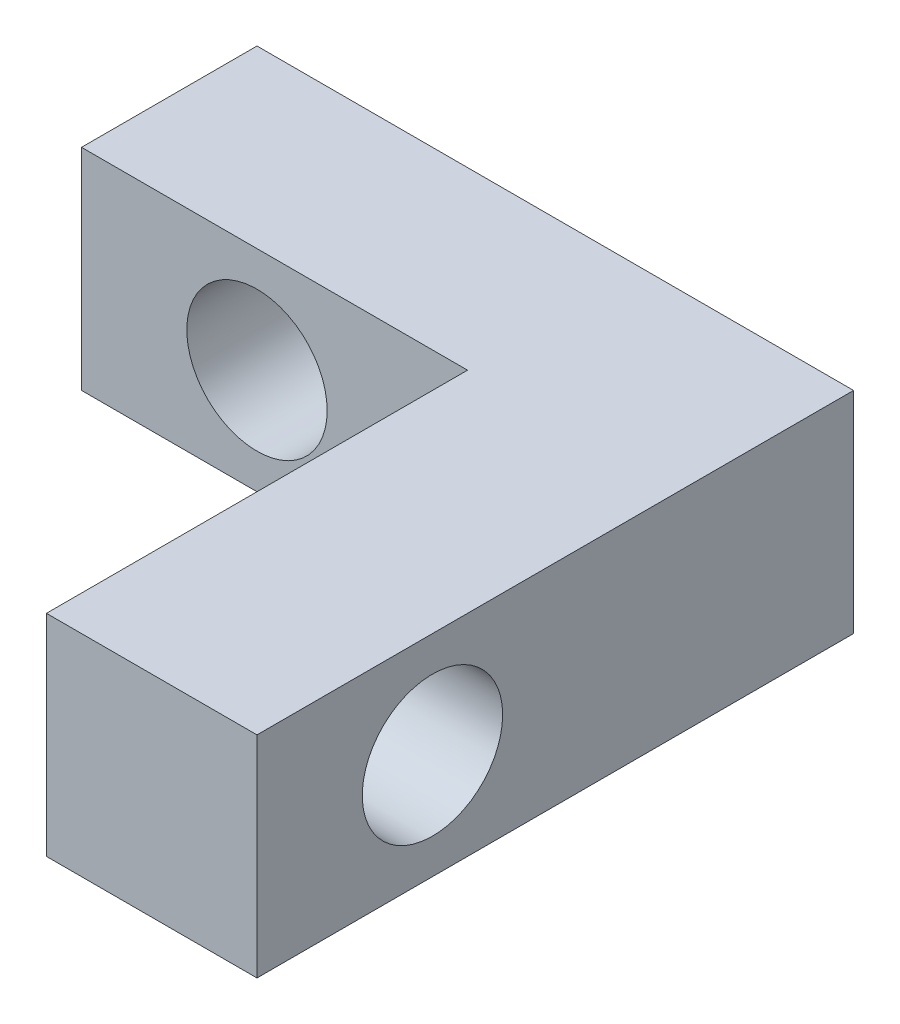
ISO-10303-21;
HEADER;
FILE_DESCRIPTION(('STEP AP214'),'2;1');
FILE_NAME('part.step','',(''),(''),'','','');
FILE_SCHEMA(('AUTOMOTIVE_DESIGN { 1 0 10303 214 1 1 1 1 }'));
ENDSEC;
DATA;
#1=APPLICATION_CONTEXT('core data for automotive mechanical design processes');
#2=APPLICATION_PROTOCOL_DEFINITION('international standard','automotive_design',2000,#1);
#3=PRODUCT_CONTEXT('',#1,'mechanical');
#4=PRODUCT('Part','Part','',(#3));
#5=PRODUCT_RELATED_PRODUCT_CATEGORY('part','',(#4));
#6=PRODUCT_DEFINITION_FORMATION('','',#4);
#7=PRODUCT_DEFINITION_CONTEXT('part definition',#1,'design');
#8=PRODUCT_DEFINITION('design','',#6,#7);
#9=PRODUCT_DEFINITION_SHAPE('','',#8);
#10=(LENGTH_UNIT() NAMED_UNIT(*) SI_UNIT(.MILLI.,.METRE.));
#11=(NAMED_UNIT(*) PLANE_ANGLE_UNIT() SI_UNIT($,.RADIAN.));
#12=(NAMED_UNIT(*) SI_UNIT($,.STERADIAN.) SOLID_ANGLE_UNIT());
#13=UNCERTAINTY_MEASURE_WITH_UNIT(LENGTH_MEASURE(1.E-05),#10,'distance_accuracy_value','');
#14=(GEOMETRIC_REPRESENTATION_CONTEXT(3) GLOBAL_UNCERTAINTY_ASSIGNED_CONTEXT((#13)) GLOBAL_UNIT_ASSIGNED_CONTEXT((#10,
#11,#12)) REPRESENTATION_CONTEXT('',''));
#15=CARTESIAN_POINT('',(0.,0.,0.));
#16=DIRECTION('',(0.,0.,1.));
#17=DIRECTION('',(1.,0.,0.));
#18=AXIS2_PLACEMENT_3D('',#15,#16,#17);
#19=CARTESIAN_POINT('',(-4.25,0.,2.5));
#20=DIRECTION('',(1.,0.,0.));
#21=DIRECTION('',(0.,0.,-1.));
#22=AXIS2_PLACEMENT_3D('',#19,#20,#21);
#23=PLANE('',#22);
#24=DIRECTION('',(0.,-1.,0.));
#25=VECTOR('',#24,1.);
#26=CARTESIAN_POINT('',(-4.25,0.,0.));
#27=LINE('',#26,#25);
#28=CARTESIAN_POINT('',(-4.25,1.5,0.));
#29=VERTEX_POINT('',#28);
#30=CARTESIAN_POINT('',(-4.25,-1.5,0.));
#31=VERTEX_POINT('',#30);
#32=EDGE_CURVE('E109',#29,#31,#27,.T.);
#33=ORIENTED_EDGE('',*,*,#32,.T.);
#34=DIRECTION('',(0.,0.,-1.));
#35=VECTOR('',#34,1.);
#36=CARTESIAN_POINT('',(-4.25,-1.5,2.5));
#37=LINE('',#36,#35);
#38=CARTESIAN_POINT('',(-4.25,-1.5,2.5));
#39=VERTEX_POINT('',#38);
#40=EDGE_CURVE('E11',#39,#31,#37,.T.);
#41=ORIENTED_EDGE('',*,*,#40,.F.);
#42=DIRECTION('',(0.,-1.,0.));
#43=VECTOR('',#42,1.);
#44=CARTESIAN_POINT('',(-4.25,0.,2.5));
#45=LINE('',#44,#43);
#46=CARTESIAN_POINT('',(-4.25,1.5,2.5));
#47=VERTEX_POINT('',#46);
#48=EDGE_CURVE('E100',#47,#39,#45,.T.);
#49=ORIENTED_EDGE('',*,*,#48,.F.);
#50=DIRECTION('',(0.,0.,-1.));
#51=VECTOR('',#50,1.);
#52=CARTESIAN_POINT('',(-4.25,1.5,2.5));
#53=LINE('',#52,#51);
#54=EDGE_CURVE('E55',#47,#29,#53,.T.);
#55=ORIENTED_EDGE('',*,*,#54,.T.);
#56=EDGE_LOOP('',(#33,#41,#49,#55));
#57=FACE_BOUND('',#56,.T.);
#58=ADVANCED_FACE('F45',(#57),#23,.F.);
#59=CARTESIAN_POINT('',(0.,-1.5,2.5));
#60=DIRECTION('',(0.,1.,0.));
#61=DIRECTION('',(-1.,0.,0.));
#62=AXIS2_PLACEMENT_3D('',#59,#60,#61);
#63=PLANE('',#62);
#64=DIRECTION('',(1.,0.,0.));
#65=VECTOR('',#64,1.);
#66=CARTESIAN_POINT('',(0.,-1.5,0.));
#67=LINE('',#66,#65);
#68=CARTESIAN_POINT('',(4.25,-1.5,0.));
#69=VERTEX_POINT('',#68);
#70=EDGE_CURVE('E75',#31,#69,#67,.T.);
#71=ORIENTED_EDGE('',*,*,#70,.T.);
#72=DIRECTION('',(0.,0.,-1.));
#73=VECTOR('',#72,1.);
#74=CARTESIAN_POINT('',(4.25,-1.5,8.5));
#75=LINE('',#74,#73);
#76=CARTESIAN_POINT('',(4.25,-1.5,8.5));
#77=VERTEX_POINT('',#76);
#78=EDGE_CURVE('E142',#77,#69,#75,.T.);
#79=ORIENTED_EDGE('',*,*,#78,.F.);
#80=DIRECTION('',(1.,0.,0.));
#81=VECTOR('',#80,1.);
#82=CARTESIAN_POINT('',(0.,-1.5,8.5));
#83=LINE('',#82,#81);
#84=CARTESIAN_POINT('',(1.25,-1.5,8.5));
#85=VERTEX_POINT('',#84);
#86=EDGE_CURVE('E146',#85,#77,#83,.T.);
#87=ORIENTED_EDGE('',*,*,#86,.F.);
#88=DIRECTION('',(0.,0.,-1.));
#89=VECTOR('',#88,1.);
#90=CARTESIAN_POINT('',(1.25,-1.5,8.5));
#91=LINE('',#90,#89);
#92=CARTESIAN_POINT('',(1.25,-1.5,2.5));
#93=VERTEX_POINT('',#92);
#94=EDGE_CURVE('E97',#85,#93,#91,.T.);
#95=ORIENTED_EDGE('',*,*,#94,.T.);
#96=DIRECTION('',(1.,0.,0.));
#97=VECTOR('',#96,1.);
#98=CARTESIAN_POINT('',(0.,-1.5,2.5));
#99=LINE('',#98,#97);
#100=EDGE_CURVE('E82',#39,#93,#99,.T.);
#101=ORIENTED_EDGE('',*,*,#100,.F.);
#102=ORIENTED_EDGE('',*,*,#40,.T.);
#103=EDGE_LOOP('',(#71,#79,#87,#95,#101,#102));
#104=FACE_BOUND('',#103,.T.);
#105=ADVANCED_FACE('F92',(#104),#63,.F.);
#106=CARTESIAN_POINT('',(-1.75,0.,2.5));
#107=DIRECTION('',(0.,0.,-1.));
#108=DIRECTION('',(-1.,0.,0.));
#109=AXIS2_PLACEMENT_3D('',#106,#107,#108);
#110=CYLINDRICAL_SURFACE('',#109,1.);
#111=CARTESIAN_POINT('',(-1.75,0.,2.5));
#112=DIRECTION('',(0.,0.,1.));
#113=DIRECTION('',(1.,0.,0.));
#114=AXIS2_PLACEMENT_3D('',#111,#112,#113);
#115=CIRCLE('',#114,1.);
#116=CARTESIAN_POINT('',(-0.750000000000002,0.,2.5));
#117=VERTEX_POINT('',#116);
#118=EDGE_CURVE('E107',#117,#117,#115,.T.);
#119=ORIENTED_EDGE('',*,*,#118,.T.);
#120=EDGE_LOOP('',(#119));
#121=FACE_BOUND('',#120,.T.);
#122=CARTESIAN_POINT('',(-1.75,0.,0.));
#123=DIRECTION('',(0.,0.,1.));
#124=DIRECTION('',(1.,0.,0.));
#125=AXIS2_PLACEMENT_3D('',#122,#123,#124);
#126=CIRCLE('',#125,1.);
#127=CARTESIAN_POINT('',(-0.750000000000002,0.,0.));
#128=VERTEX_POINT('',#127);
#129=EDGE_CURVE('E112',#128,#128,#126,.T.);
#130=ORIENTED_EDGE('',*,*,#129,.F.);
#131=EDGE_LOOP('',(#130));
#132=FACE_BOUND('',#131,.T.);
#133=ADVANCED_FACE('F47',(#121,#132),#110,.F.);
#134=CARTESIAN_POINT('',(0.,1.5,2.5));
#135=DIRECTION('',(0.,1.,0.));
#136=DIRECTION('',(-1.,0.,0.));
#137=AXIS2_PLACEMENT_3D('',#134,#135,#136);
#138=PLANE('',#137);
#139=DIRECTION('',(1.,0.,0.));
#140=VECTOR('',#139,1.);
#141=CARTESIAN_POINT('',(0.,1.5,0.));
#142=LINE('',#141,#140);
#143=CARTESIAN_POINT('',(4.25,1.5,0.));
#144=VERTEX_POINT('',#143);
#145=EDGE_CURVE('E116',#29,#144,#142,.T.);
#146=ORIENTED_EDGE('',*,*,#145,.F.);
#147=ORIENTED_EDGE('',*,*,#54,.F.);
#148=DIRECTION('',(1.,0.,0.));
#149=VECTOR('',#148,1.);
#150=CARTESIAN_POINT('',(0.,1.5,2.5));
#151=LINE('',#150,#149);
#152=CARTESIAN_POINT('',(1.25,1.5,2.5));
#153=VERTEX_POINT('',#152);
#154=EDGE_CURVE('E104',#47,#153,#151,.T.);
#155=ORIENTED_EDGE('',*,*,#154,.T.);
#156=DIRECTION('',(0.,0.,-1.));
#157=VECTOR('',#156,1.);
#158=CARTESIAN_POINT('',(1.25,1.5,8.5));
#159=LINE('',#158,#157);
#160=CARTESIAN_POINT('',(1.25,1.5,8.5));
#161=VERTEX_POINT('',#160);
#162=EDGE_CURVE('E137',#161,#153,#159,.T.);
#163=ORIENTED_EDGE('',*,*,#162,.F.);
#164=DIRECTION('',(1.,0.,0.));
#165=VECTOR('',#164,1.);
#166=CARTESIAN_POINT('',(0.,1.5,8.5));
#167=LINE('',#166,#165);
#168=CARTESIAN_POINT('',(4.25,1.5,8.5));
#169=VERTEX_POINT('',#168);
#170=EDGE_CURVE('E158',#161,#169,#167,.T.);
#171=ORIENTED_EDGE('',*,*,#170,.T.);
#172=DIRECTION('',(0.,0.,-1.));
#173=VECTOR('',#172,1.);
#174=CARTESIAN_POINT('',(4.25,1.5,8.5));
#175=LINE('',#174,#173);
#176=EDGE_CURVE('E119',#169,#144,#175,.T.);
#177=ORIENTED_EDGE('',*,*,#176,.T.);
#178=EDGE_LOOP('',(#146,#147,#155,#163,#171,#177));
#179=FACE_BOUND('',#178,.T.);
#180=ADVANCED_FACE('F197',(#179),#138,.T.);
#181=CARTESIAN_POINT('',(0.,0.,2.5));
#182=DIRECTION('',(0.,0.,1.));
#183=DIRECTION('',(1.,0.,0.));
#184=AXIS2_PLACEMENT_3D('',#181,#182,#183);
#185=PLANE('',#184);
#186=ORIENTED_EDGE('',*,*,#118,.F.);
#187=EDGE_LOOP('',(#186));
#188=FACE_BOUND('',#187,.T.);
#189=ORIENTED_EDGE('',*,*,#48,.T.);
#190=ORIENTED_EDGE('',*,*,#100,.T.);
#191=DIRECTION('',(0.,-1.,0.));
#192=VECTOR('',#191,1.);
#193=CARTESIAN_POINT('',(1.25,0.,2.5));
#194=LINE('',#193,#192);
#195=EDGE_CURVE('E99',#153,#93,#194,.T.);
#196=ORIENTED_EDGE('',*,*,#195,.F.);
#197=ORIENTED_EDGE('',*,*,#154,.F.);
#198=EDGE_LOOP('',(#189,#190,#196,#197));
#199=FACE_BOUND('',#198,.T.);
#200=ADVANCED_FACE('F103',(#188,#199),#185,.T.);
#201=CARTESIAN_POINT('',(0.,0.,0.));
#202=DIRECTION('',(0.,0.,1.));
#203=DIRECTION('',(1.,0.,0.));
#204=AXIS2_PLACEMENT_3D('',#201,#202,#203);
#205=PLANE('',#204);
#206=ORIENTED_EDGE('',*,*,#129,.T.);
#207=EDGE_LOOP('',(#206));
#208=FACE_BOUND('',#207,.T.);
#209=ORIENTED_EDGE('',*,*,#32,.F.);
#210=ORIENTED_EDGE('',*,*,#145,.T.);
#211=DIRECTION('',(0.,-1.,0.));
#212=VECTOR('',#211,1.);
#213=CARTESIAN_POINT('',(4.25,0.,0.));
#214=LINE('',#213,#212);
#215=EDGE_CURVE('E147',#144,#69,#214,.T.);
#216=ORIENTED_EDGE('',*,*,#215,.T.);
#217=ORIENTED_EDGE('',*,*,#70,.F.);
#218=EDGE_LOOP('',(#209,#210,#216,#217));
#219=FACE_BOUND('',#218,.T.);
#220=ADVANCED_FACE('F188',(#208,#219),#205,.F.);
#221=CARTESIAN_POINT('',(1.25,0.,8.5));
#222=DIRECTION('',(1.,0.,0.));
#223=DIRECTION('',(0.,0.,-1.));
#224=AXIS2_PLACEMENT_3D('',#221,#222,#223);
#225=PLANE('',#224);
#226=CARTESIAN_POINT('',(1.25,0.,6.));
#227=DIRECTION('',(1.,0.,0.));
#228=DIRECTION('',(0.,0.,-1.));
#229=AXIS2_PLACEMENT_3D('',#226,#227,#228);
#230=CIRCLE('',#229,0.999999999999999);
#231=CARTESIAN_POINT('',(1.25,0.,5.));
#232=VERTEX_POINT('',#231);
#233=EDGE_CURVE('E151',#232,#232,#230,.F.);
#234=ORIENTED_EDGE('',*,*,#233,.F.);
#235=EDGE_LOOP('',(#234));
#236=FACE_BOUND('',#235,.T.);
#237=ORIENTED_EDGE('',*,*,#162,.T.);
#238=ORIENTED_EDGE('',*,*,#195,.T.);
#239=ORIENTED_EDGE('',*,*,#94,.F.);
#240=DIRECTION('',(0.,-1.,0.));
#241=VECTOR('',#240,1.);
#242=CARTESIAN_POINT('',(1.25,0.,8.5));
#243=LINE('',#242,#241);
#244=EDGE_CURVE('E154',#161,#85,#243,.T.);
#245=ORIENTED_EDGE('',*,*,#244,.F.);
#246=EDGE_LOOP('',(#237,#238,#239,#245));
#247=FACE_BOUND('',#246,.T.);
#248=ADVANCED_FACE('F180',(#236,#247),#225,.F.);
#249=CARTESIAN_POINT('',(4.25,0.,8.5));
#250=DIRECTION('',(1.,0.,0.));
#251=DIRECTION('',(0.,0.,-1.));
#252=AXIS2_PLACEMENT_3D('',#249,#250,#251);
#253=PLANE('',#252);
#254=CARTESIAN_POINT('',(4.25,0.,6.));
#255=DIRECTION('',(1.,0.,0.));
#256=DIRECTION('',(0.,0.,-1.));
#257=AXIS2_PLACEMENT_3D('',#254,#255,#256);
#258=CIRCLE('',#257,0.999999999999999);
#259=CARTESIAN_POINT('',(4.25,0.,5.));
#260=VERTEX_POINT('',#259);
#261=EDGE_CURVE('E168',#260,#260,#258,.T.);
#262=ORIENTED_EDGE('',*,*,#261,.F.);
#263=EDGE_LOOP('',(#262));
#264=FACE_BOUND('',#263,.T.);
#265=ORIENTED_EDGE('',*,*,#215,.F.);
#266=ORIENTED_EDGE('',*,*,#176,.F.);
#267=DIRECTION('',(0.,-1.,0.));
#268=VECTOR('',#267,1.);
#269=CARTESIAN_POINT('',(4.25,0.,8.5));
#270=LINE('',#269,#268);
#271=EDGE_CURVE('E150',#169,#77,#270,.T.);
#272=ORIENTED_EDGE('',*,*,#271,.T.);
#273=ORIENTED_EDGE('',*,*,#78,.T.);
#274=EDGE_LOOP('',(#265,#266,#272,#273));
#275=FACE_BOUND('',#274,.T.);
#276=ADVANCED_FACE('F176',(#264,#275),#253,.T.);
#277=CARTESIAN_POINT('',(0.,0.,8.5));
#278=DIRECTION('',(0.,0.,1.));
#279=DIRECTION('',(1.,0.,0.));
#280=AXIS2_PLACEMENT_3D('',#277,#278,#279);
#281=PLANE('',#280);
#282=ORIENTED_EDGE('',*,*,#271,.F.);
#283=ORIENTED_EDGE('',*,*,#170,.F.);
#284=ORIENTED_EDGE('',*,*,#244,.T.);
#285=ORIENTED_EDGE('',*,*,#86,.T.);
#286=EDGE_LOOP('',(#282,#283,#284,#285));
#287=FACE_BOUND('',#286,.T.);
#288=ADVANCED_FACE('F179',(#287),#281,.T.);
#289=CARTESIAN_POINT('',(-4.251,0.,6.));
#290=DIRECTION('',(1.,0.,0.));
#291=DIRECTION('',(0.,0.,-1.));
#292=AXIS2_PLACEMENT_3D('',#289,#290,#291);
#293=CYLINDRICAL_SURFACE('',#292,0.999999999999999);
#294=ORIENTED_EDGE('',*,*,#261,.T.);
#295=EDGE_LOOP('',(#294));
#296=FACE_BOUND('',#295,.T.);
#297=ORIENTED_EDGE('',*,*,#233,.T.);
#298=EDGE_LOOP('',(#297));
#299=FACE_BOUND('',#298,.T.);
#300=ADVANCED_FACE('F173',(#296,#299),#293,.F.);
#301=CLOSED_SHELL('',(#58,#105,#133,#180,#200,#220,#248,#276,#288,#300));
#302=MANIFOLD_SOLID_BREP('B2',#301);
#303=ADVANCED_BREP_SHAPE_REPRESENTATION('',(#18,#302),#14);
#304=SHAPE_DEFINITION_REPRESENTATION(#9,#303);
ENDSEC;
END-ISO-10303-21;
